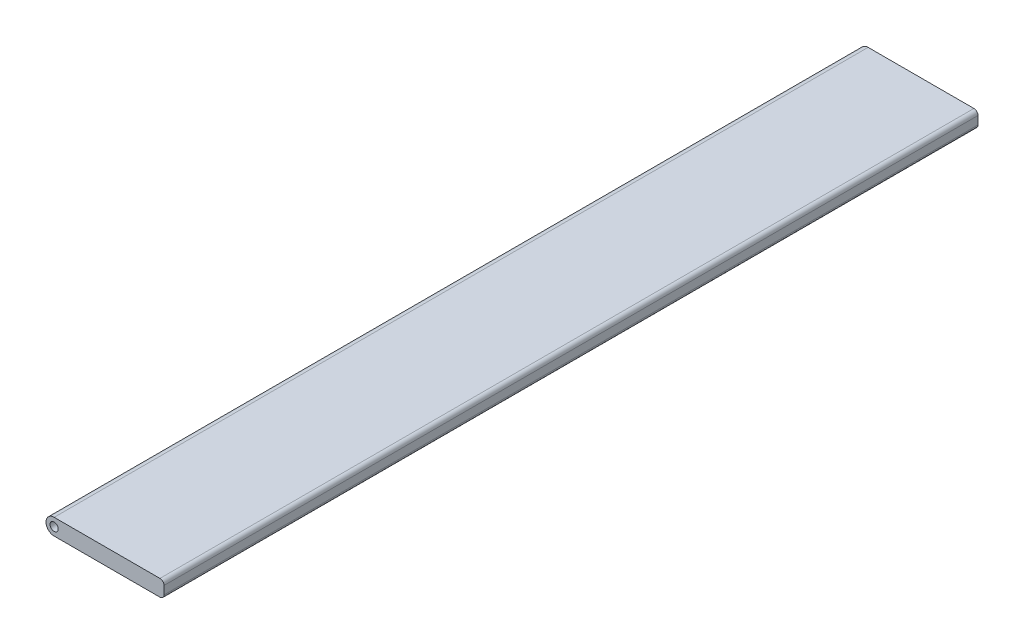
ISO-10303-21;
HEADER;
FILE_DESCRIPTION(('STEP AP214'),'2;1');
FILE_NAME('part.step','',(''),(''),'','','');
FILE_SCHEMA(('AUTOMOTIVE_DESIGN { 1 0 10303 214 1 1 1 1 }'));
ENDSEC;
DATA;
#1=APPLICATION_CONTEXT('core data for automotive mechanical design processes');
#2=APPLICATION_PROTOCOL_DEFINITION('international standard','automotive_design',2000,#1);
#3=PRODUCT_CONTEXT('',#1,'mechanical');
#4=PRODUCT('Part','Part','',(#3));
#5=PRODUCT_RELATED_PRODUCT_CATEGORY('part','',(#4));
#6=PRODUCT_DEFINITION_FORMATION('','',#4);
#7=PRODUCT_DEFINITION_CONTEXT('part definition',#1,'design');
#8=PRODUCT_DEFINITION('design','',#6,#7);
#9=PRODUCT_DEFINITION_SHAPE('','',#8);
#10=(LENGTH_UNIT() NAMED_UNIT(*) SI_UNIT(.MILLI.,.METRE.));
#11=(NAMED_UNIT(*) PLANE_ANGLE_UNIT() SI_UNIT($,.RADIAN.));
#12=(NAMED_UNIT(*) SI_UNIT($,.STERADIAN.) SOLID_ANGLE_UNIT());
#13=UNCERTAINTY_MEASURE_WITH_UNIT(LENGTH_MEASURE(1.E-05),#10,'distance_accuracy_value','');
#14=(GEOMETRIC_REPRESENTATION_CONTEXT(3) GLOBAL_UNCERTAINTY_ASSIGNED_CONTEXT((#13)) GLOBAL_UNIT_ASSIGNED_CONTEXT((#10,
#11,#12)) REPRESENTATION_CONTEXT('',''));
#15=CARTESIAN_POINT('',(0.,0.,0.));
#16=DIRECTION('',(0.,0.,1.));
#17=DIRECTION('',(1.,0.,0.));
#18=AXIS2_PLACEMENT_3D('',#15,#16,#17);
#19=CARTESIAN_POINT('',(0.,0.,200.));
#20=DIRECTION('',(0.,0.,-1.));
#21=DIRECTION('',(-1.,0.,0.));
#22=AXIS2_PLACEMENT_3D('',#19,#20,#21);
#23=CYLINDRICAL_SURFACE('',#22,2.);
#24=CARTESIAN_POINT('',(0.,0.,0.));
#25=DIRECTION('',(0.,0.,1.));
#26=DIRECTION('',(1.,0.,0.));
#27=AXIS2_PLACEMENT_3D('',#24,#25,#26);
#28=CIRCLE('',#27,2.);
#29=CARTESIAN_POINT('',(0.,2.,0.));
#30=VERTEX_POINT('',#29);
#31=CARTESIAN_POINT('',(0.,-2.,0.));
#32=VERTEX_POINT('',#31);
#33=EDGE_CURVE('E124',#30,#32,#28,.T.);
#34=ORIENTED_EDGE('',*,*,#33,.T.);
#35=DIRECTION('',(0.,0.,-1.));
#36=VECTOR('',#35,1.);
#37=CARTESIAN_POINT('',(0.,-2.,200.));
#38=LINE('',#37,#36);
#39=CARTESIAN_POINT('',(0.,-2.,200.));
#40=VERTEX_POINT('',#39);
#41=EDGE_CURVE('E11',#40,#32,#38,.T.);
#42=ORIENTED_EDGE('',*,*,#41,.F.);
#43=CARTESIAN_POINT('',(0.,0.,200.));
#44=DIRECTION('',(0.,0.,1.));
#45=DIRECTION('',(1.,0.,0.));
#46=AXIS2_PLACEMENT_3D('',#43,#44,#45);
#47=CIRCLE('',#46,2.);
#48=CARTESIAN_POINT('',(0.,2.,200.));
#49=VERTEX_POINT('',#48);
#50=EDGE_CURVE('E139',#49,#40,#47,.T.);
#51=ORIENTED_EDGE('',*,*,#50,.F.);
#52=DIRECTION('',(0.,0.,-1.));
#53=VECTOR('',#52,1.);
#54=CARTESIAN_POINT('',(0.,2.,200.));
#55=LINE('',#54,#53);
#56=EDGE_CURVE('E51',#49,#30,#55,.T.);
#57=ORIENTED_EDGE('',*,*,#56,.T.);
#58=EDGE_LOOP('',(#34,#42,#51,#57));
#59=FACE_BOUND('',#58,.T.);
#60=ADVANCED_FACE('F35',(#59),#23,.T.);
#61=CARTESIAN_POINT('',(0.,-2.,200.));
#62=DIRECTION('',(0.,1.,0.));
#63=DIRECTION('',(-1.,0.,0.));
#64=AXIS2_PLACEMENT_3D('',#61,#62,#63);
#65=PLANE('',#64);
#66=DIRECTION('',(1.,0.,0.));
#67=VECTOR('',#66,1.);
#68=CARTESIAN_POINT('',(0.,-2.,0.));
#69=LINE('',#68,#67);
#70=CARTESIAN_POINT('',(26.,-2.,0.));
#71=VERTEX_POINT('',#70);
#72=EDGE_CURVE('E126',#32,#71,#69,.T.);
#73=ORIENTED_EDGE('',*,*,#72,.T.);
#74=DIRECTION('',(0.,0.,-1.));
#75=VECTOR('',#74,1.);
#76=CARTESIAN_POINT('',(26.,-2.,200.));
#77=LINE('',#76,#75);
#78=CARTESIAN_POINT('',(26.,-2.,200.));
#79=VERTEX_POINT('',#78);
#80=EDGE_CURVE('E43',#79,#71,#77,.T.);
#81=ORIENTED_EDGE('',*,*,#80,.F.);
#82=DIRECTION('',(1.,0.,0.));
#83=VECTOR('',#82,1.);
#84=CARTESIAN_POINT('',(0.,-2.,200.));
#85=LINE('',#84,#83);
#86=EDGE_CURVE('E83',#40,#79,#85,.T.);
#87=ORIENTED_EDGE('',*,*,#86,.F.);
#88=ORIENTED_EDGE('',*,*,#41,.T.);
#89=EDGE_LOOP('',(#73,#81,#87,#88));
#90=FACE_BOUND('',#89,.T.);
#91=ADVANCED_FACE('F161',(#90),#65,.F.);
#92=CARTESIAN_POINT('',(26.,-1.,200.));
#93=DIRECTION('',(0.,0.,-1.));
#94=DIRECTION('',(-1.,0.,0.));
#95=AXIS2_PLACEMENT_3D('',#92,#93,#94);
#96=CYLINDRICAL_SURFACE('',#95,0.999999999999999);
#97=CARTESIAN_POINT('',(26.,-1.,0.));
#98=DIRECTION('',(0.,0.,1.));
#99=DIRECTION('',(1.,0.,0.));
#100=AXIS2_PLACEMENT_3D('',#97,#98,#99);
#101=CIRCLE('',#100,0.999999999999999);
#102=CARTESIAN_POINT('',(27.,-1.,0.));
#103=VERTEX_POINT('',#102);
#104=EDGE_CURVE('E128',#71,#103,#101,.T.);
#105=ORIENTED_EDGE('',*,*,#104,.T.);
#106=DIRECTION('',(0.,0.,-1.));
#107=VECTOR('',#106,1.);
#108=CARTESIAN_POINT('',(27.,-1.,200.));
#109=LINE('',#108,#107);
#110=CARTESIAN_POINT('',(27.,-1.,200.));
#111=VERTEX_POINT('',#110);
#112=EDGE_CURVE('E113',#111,#103,#109,.T.);
#113=ORIENTED_EDGE('',*,*,#112,.F.);
#114=CARTESIAN_POINT('',(26.,-1.,200.));
#115=DIRECTION('',(0.,0.,1.));
#116=DIRECTION('',(1.,0.,0.));
#117=AXIS2_PLACEMENT_3D('',#114,#115,#116);
#118=CIRCLE('',#117,0.999999999999999);
#119=EDGE_CURVE('E101',#79,#111,#118,.T.);
#120=ORIENTED_EDGE('',*,*,#119,.F.);
#121=ORIENTED_EDGE('',*,*,#80,.T.);
#122=EDGE_LOOP('',(#105,#113,#120,#121));
#123=FACE_BOUND('',#122,.T.);
#124=ADVANCED_FACE('F145',(#123),#96,.T.);
#125=CARTESIAN_POINT('',(27.,0.,200.));
#126=DIRECTION('',(-1.,0.,0.));
#127=DIRECTION('',(0.,0.,1.));
#128=AXIS2_PLACEMENT_3D('',#125,#126,#127);
#129=PLANE('',#128);
#130=DIRECTION('',(0.,1.,0.));
#131=VECTOR('',#130,1.);
#132=CARTESIAN_POINT('',(27.,0.,0.));
#133=LINE('',#132,#131);
#134=CARTESIAN_POINT('',(27.,1.,0.));
#135=VERTEX_POINT('',#134);
#136=EDGE_CURVE('E110',#103,#135,#133,.T.);
#137=ORIENTED_EDGE('',*,*,#136,.T.);
#138=DIRECTION('',(0.,0.,-1.));
#139=VECTOR('',#138,1.);
#140=CARTESIAN_POINT('',(27.,1.,200.));
#141=LINE('',#140,#139);
#142=CARTESIAN_POINT('',(27.,1.,200.));
#143=VERTEX_POINT('',#142);
#144=EDGE_CURVE('E107',#143,#135,#141,.T.);
#145=ORIENTED_EDGE('',*,*,#144,.F.);
#146=DIRECTION('',(0.,1.,0.));
#147=VECTOR('',#146,1.);
#148=CARTESIAN_POINT('',(27.,0.,200.));
#149=LINE('',#148,#147);
#150=EDGE_CURVE('E93',#111,#143,#149,.T.);
#151=ORIENTED_EDGE('',*,*,#150,.F.);
#152=ORIENTED_EDGE('',*,*,#112,.T.);
#153=EDGE_LOOP('',(#137,#145,#151,#152));
#154=FACE_BOUND('',#153,.T.);
#155=ADVANCED_FACE('F108',(#154),#129,.F.);
#156=CARTESIAN_POINT('',(26.,1.,200.));
#157=DIRECTION('',(0.,0.,-1.));
#158=DIRECTION('',(-1.,0.,0.));
#159=AXIS2_PLACEMENT_3D('',#156,#157,#158);
#160=CYLINDRICAL_SURFACE('',#159,0.999999999999999);
#161=CARTESIAN_POINT('',(26.,1.,0.));
#162=DIRECTION('',(0.,0.,1.));
#163=DIRECTION('',(1.,0.,0.));
#164=AXIS2_PLACEMENT_3D('',#161,#162,#163);
#165=CIRCLE('',#164,0.999999999999999);
#166=CARTESIAN_POINT('',(26.,2.,0.));
#167=VERTEX_POINT('',#166);
#168=EDGE_CURVE('E131',#167,#135,#165,.F.);
#169=ORIENTED_EDGE('',*,*,#168,.F.);
#170=DIRECTION('',(0.,0.,-1.));
#171=VECTOR('',#170,1.);
#172=CARTESIAN_POINT('',(26.,2.,200.));
#173=LINE('',#172,#171);
#174=CARTESIAN_POINT('',(26.,2.,200.));
#175=VERTEX_POINT('',#174);
#176=EDGE_CURVE('E71',#175,#167,#173,.T.);
#177=ORIENTED_EDGE('',*,*,#176,.F.);
#178=CARTESIAN_POINT('',(26.,1.,200.));
#179=DIRECTION('',(0.,0.,1.));
#180=DIRECTION('',(1.,0.,0.));
#181=AXIS2_PLACEMENT_3D('',#178,#179,#180);
#182=CIRCLE('',#181,0.999999999999999);
#183=EDGE_CURVE('E99',#175,#143,#182,.F.);
#184=ORIENTED_EDGE('',*,*,#183,.T.);
#185=ORIENTED_EDGE('',*,*,#144,.T.);
#186=EDGE_LOOP('',(#169,#177,#184,#185));
#187=FACE_BOUND('',#186,.T.);
#188=ADVANCED_FACE('F115',(#187),#160,.T.);
#189=CARTESIAN_POINT('',(0.,2.,200.));
#190=DIRECTION('',(0.,1.,0.));
#191=DIRECTION('',(-1.,0.,0.));
#192=AXIS2_PLACEMENT_3D('',#189,#190,#191);
#193=PLANE('',#192);
#194=DIRECTION('',(1.,0.,0.));
#195=VECTOR('',#194,1.);
#196=CARTESIAN_POINT('',(0.,2.,0.));
#197=LINE('',#196,#195);
#198=EDGE_CURVE('E133',#30,#167,#197,.T.);
#199=ORIENTED_EDGE('',*,*,#198,.F.);
#200=ORIENTED_EDGE('',*,*,#56,.F.);
#201=DIRECTION('',(1.,0.,0.));
#202=VECTOR('',#201,1.);
#203=CARTESIAN_POINT('',(0.,2.,200.));
#204=LINE('',#203,#202);
#205=EDGE_CURVE('E116',#49,#175,#204,.T.);
#206=ORIENTED_EDGE('',*,*,#205,.T.);
#207=ORIENTED_EDGE('',*,*,#176,.T.);
#208=EDGE_LOOP('',(#199,#200,#206,#207));
#209=FACE_BOUND('',#208,.T.);
#210=ADVANCED_FACE('F149',(#209),#193,.T.);
#211=CARTESIAN_POINT('',(0.,0.,200.));
#212=DIRECTION('',(0.,0.,-1.));
#213=DIRECTION('',(-1.,0.,0.));
#214=AXIS2_PLACEMENT_3D('',#211,#212,#213);
#215=CYLINDRICAL_SURFACE('',#214,1.);
#216=CARTESIAN_POINT('',(0.,0.,200.));
#217=DIRECTION('',(0.,0.,1.));
#218=DIRECTION('',(1.,0.,0.));
#219=AXIS2_PLACEMENT_3D('',#216,#217,#218);
#220=CIRCLE('',#219,1.);
#221=CARTESIAN_POINT('',(1.,0.,200.));
#222=VERTEX_POINT('',#221);
#223=EDGE_CURVE('E118',#222,#222,#220,.T.);
#224=ORIENTED_EDGE('',*,*,#223,.T.);
#225=EDGE_LOOP('',(#224));
#226=FACE_BOUND('',#225,.T.);
#227=CARTESIAN_POINT('',(0.,0.,0.));
#228=DIRECTION('',(0.,0.,1.));
#229=DIRECTION('',(1.,0.,0.));
#230=AXIS2_PLACEMENT_3D('',#227,#228,#229);
#231=CIRCLE('',#230,1.);
#232=CARTESIAN_POINT('',(1.,0.,0.));
#233=VERTEX_POINT('',#232);
#234=EDGE_CURVE('E136',#233,#233,#231,.T.);
#235=ORIENTED_EDGE('',*,*,#234,.F.);
#236=EDGE_LOOP('',(#235));
#237=FACE_BOUND('',#236,.T.);
#238=ADVANCED_FACE('F151',(#226,#237),#215,.F.);
#239=CARTESIAN_POINT('',(0.,0.,200.));
#240=DIRECTION('',(0.,0.,1.));
#241=DIRECTION('',(1.,0.,0.));
#242=AXIS2_PLACEMENT_3D('',#239,#240,#241);
#243=PLANE('',#242);
#244=ORIENTED_EDGE('',*,*,#50,.T.);
#245=ORIENTED_EDGE('',*,*,#86,.T.);
#246=ORIENTED_EDGE('',*,*,#119,.T.);
#247=ORIENTED_EDGE('',*,*,#150,.T.);
#248=ORIENTED_EDGE('',*,*,#183,.F.);
#249=ORIENTED_EDGE('',*,*,#205,.F.);
#250=EDGE_LOOP('',(#244,#245,#246,#247,#248,#249));
#251=FACE_BOUND('',#250,.T.);
#252=ORIENTED_EDGE('',*,*,#223,.F.);
#253=EDGE_LOOP('',(#252));
#254=FACE_BOUND('',#253,.T.);
#255=ADVANCED_FACE('F95',(#251,#254),#243,.T.);
#256=CARTESIAN_POINT('',(0.,0.,0.));
#257=DIRECTION('',(0.,0.,1.));
#258=DIRECTION('',(1.,0.,0.));
#259=AXIS2_PLACEMENT_3D('',#256,#257,#258);
#260=PLANE('',#259);
#261=ORIENTED_EDGE('',*,*,#33,.F.);
#262=ORIENTED_EDGE('',*,*,#198,.T.);
#263=ORIENTED_EDGE('',*,*,#168,.T.);
#264=ORIENTED_EDGE('',*,*,#136,.F.);
#265=ORIENTED_EDGE('',*,*,#104,.F.);
#266=ORIENTED_EDGE('',*,*,#72,.F.);
#267=EDGE_LOOP('',(#261,#262,#263,#264,#265,#266));
#268=FACE_BOUND('',#267,.T.);
#269=ORIENTED_EDGE('',*,*,#234,.T.);
#270=EDGE_LOOP('',(#269));
#271=FACE_BOUND('',#270,.T.);
#272=ADVANCED_FACE('F147',(#268,#271),#260,.F.);
#273=CLOSED_SHELL('',(#60,#91,#124,#155,#188,#210,#238,#255,#272));
#274=MANIFOLD_SOLID_BREP('B2',#273);
#275=ADVANCED_BREP_SHAPE_REPRESENTATION('',(#18,#274),#14);
#276=SHAPE_DEFINITION_REPRESENTATION(#9,#275);
ENDSEC;
END-ISO-10303-21;
